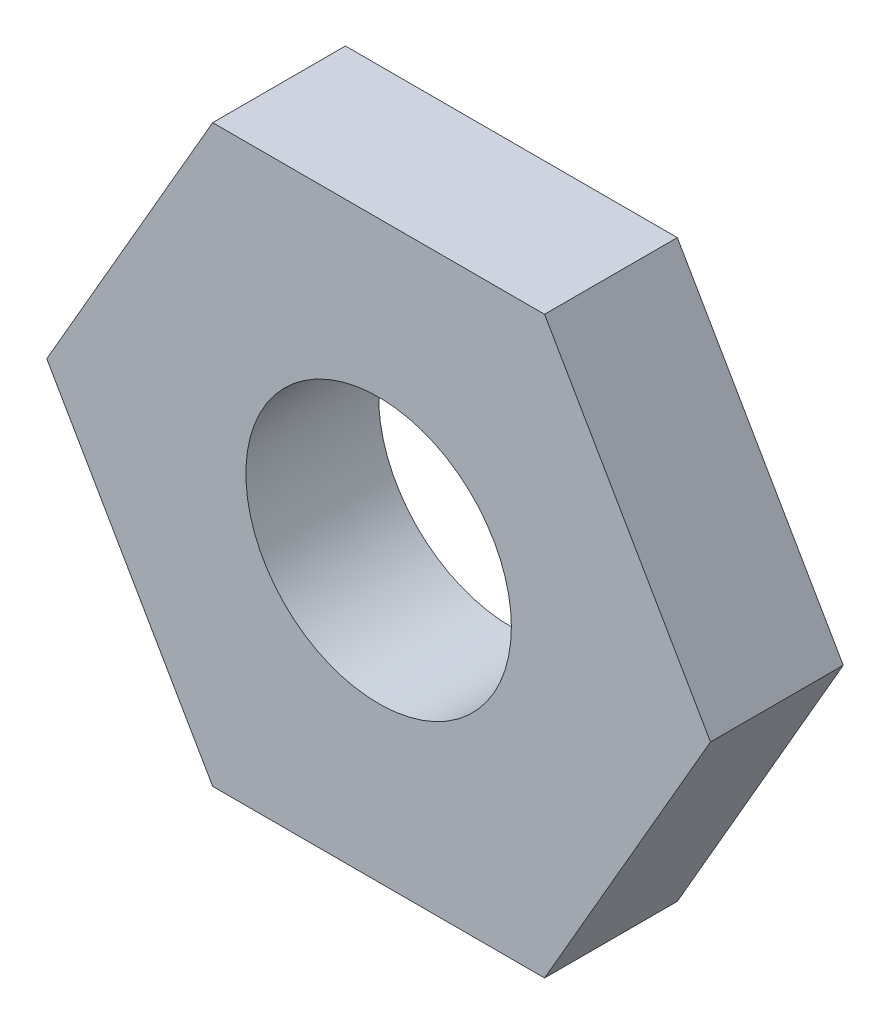
ISO-10303-21;
HEADER;
FILE_DESCRIPTION(('STEP AP214'),'2;1');
FILE_NAME('part.step','',(''),(''),'','','');
FILE_SCHEMA(('AUTOMOTIVE_DESIGN { 1 0 10303 214 1 1 1 1 }'));
ENDSEC;
DATA;
#1=APPLICATION_CONTEXT('core data for automotive mechanical design processes');
#2=APPLICATION_PROTOCOL_DEFINITION('international standard','automotive_design',2000,#1);
#3=PRODUCT_CONTEXT('',#1,'mechanical');
#4=PRODUCT('Part','Part','',(#3));
#5=PRODUCT_RELATED_PRODUCT_CATEGORY('part','',(#4));
#6=PRODUCT_DEFINITION_FORMATION('','',#4);
#7=PRODUCT_DEFINITION_CONTEXT('part definition',#1,'design');
#8=PRODUCT_DEFINITION('design','',#6,#7);
#9=PRODUCT_DEFINITION_SHAPE('','',#8);
#10=(LENGTH_UNIT() NAMED_UNIT(*) SI_UNIT(.MILLI.,.METRE.));
#11=(NAMED_UNIT(*) PLANE_ANGLE_UNIT() SI_UNIT($,.RADIAN.));
#12=(NAMED_UNIT(*) SI_UNIT($,.STERADIAN.) SOLID_ANGLE_UNIT());
#13=UNCERTAINTY_MEASURE_WITH_UNIT(LENGTH_MEASURE(1.E-05),#10,'distance_accuracy_value','');
#14=(GEOMETRIC_REPRESENTATION_CONTEXT(3) GLOBAL_UNCERTAINTY_ASSIGNED_CONTEXT((#13)) GLOBAL_UNIT_ASSIGNED_CONTEXT((#10,
#11,#12)) REPRESENTATION_CONTEXT('',''));
#15=CARTESIAN_POINT('',(0.,0.,0.));
#16=DIRECTION('',(0.,0.,1.));
#17=DIRECTION('',(1.,0.,0.));
#18=AXIS2_PLACEMENT_3D('',#15,#16,#17);
#19=CARTESIAN_POINT('',(0.,0.,2.));
#20=DIRECTION('',(0.,0.,-1.));
#21=DIRECTION('',(-1.,0.,0.));
#22=AXIS2_PLACEMENT_3D('',#19,#20,#21);
#23=PLANE('',#22);
#24=DIRECTION('',(0.499999942468329,-0.866025437000362,0.));
#25=VECTOR('',#24,1.);
#26=CARTESIAN_POINT('',(-2.50000028765834,-4.33012718500182,2.));
#27=LINE('',#26,#25);
#28=CARTESIAN_POINT('',(-4.99999999999999,0.,2.));
#29=VERTEX_POINT('',#28);
#30=CARTESIAN_POINT('',(-2.50000028765834,-4.33012718500182,2.));
#31=VERTEX_POINT('',#30);
#32=EDGE_CURVE('E129',#29,#31,#27,.T.);
#33=ORIENTED_EDGE('',*,*,#32,.T.);
#34=DIRECTION('',(1.,0.,0.));
#35=VECTOR('',#34,1.);
#36=CARTESIAN_POINT('',(2.49999990411389,-4.33012718500182,2.));
#37=LINE('',#36,#35);
#38=CARTESIAN_POINT('',(2.49999990411389,-4.33012718500182,2.));
#39=VERTEX_POINT('',#38);
#40=EDGE_CURVE('E87',#31,#39,#37,.T.);
#41=ORIENTED_EDGE('',*,*,#40,.T.);
#42=DIRECTION('',(0.499999999999998,0.86602540378444,0.));
#43=VECTOR('',#42,1.);
#44=CARTESIAN_POINT('',(4.99999999999999,0.,2.));
#45=LINE('',#44,#43);
#46=CARTESIAN_POINT('',(4.99999999999999,0.,2.));
#47=VERTEX_POINT('',#46);
#48=EDGE_CURVE('E100',#39,#47,#45,.T.);
#49=ORIENTED_EDGE('',*,*,#48,.T.);
#50=DIRECTION('',(-0.499999999999998,0.86602540378444,0.));
#51=VECTOR('',#50,1.);
#52=CARTESIAN_POINT('',(2.5,4.3301270189222,2.));
#53=LINE('',#52,#51);
#54=CARTESIAN_POINT('',(2.5,4.3301270189222,2.));
#55=VERTEX_POINT('',#54);
#56=EDGE_CURVE('E94',#47,#55,#53,.T.);
#57=ORIENTED_EDGE('',*,*,#56,.T.);
#58=DIRECTION('',(-1.,0.,0.));
#59=VECTOR('',#58,1.);
#60=CARTESIAN_POINT('',(-2.5,4.3301270189222,2.));
#61=LINE('',#60,#59);
#62=CARTESIAN_POINT('',(-2.5,4.3301270189222,2.));
#63=VERTEX_POINT('',#62);
#64=EDGE_CURVE('E98',#55,#63,#61,.T.);
#65=ORIENTED_EDGE('',*,*,#64,.T.);
#66=DIRECTION('',(-0.499999999999998,-0.86602540378444,0.));
#67=VECTOR('',#66,1.);
#68=CARTESIAN_POINT('',(-4.99999999999999,0.,2.));
#69=LINE('',#68,#67);
#70=EDGE_CURVE('E50',#63,#29,#69,.T.);
#71=ORIENTED_EDGE('',*,*,#70,.T.);
#72=EDGE_LOOP('',(#33,#41,#49,#57,#65,#71));
#73=FACE_BOUND('',#72,.T.);
#74=CARTESIAN_POINT('',(0.,0.,2.));
#75=DIRECTION('',(0.,0.,1.));
#76=DIRECTION('',(1.,0.,0.));
#77=AXIS2_PLACEMENT_3D('',#74,#75,#76);
#78=CIRCLE('',#77,2.);
#79=CARTESIAN_POINT('',(2.,0.,2.));
#80=VERTEX_POINT('',#79);
#81=EDGE_CURVE('E122',#80,#80,#78,.T.);
#82=ORIENTED_EDGE('',*,*,#81,.F.);
#83=EDGE_LOOP('',(#82));
#84=FACE_BOUND('',#83,.T.);
#85=ADVANCED_FACE('F33',(#73,#84),#23,.F.);
#86=CARTESIAN_POINT('',(0.,0.,0.));
#87=DIRECTION('',(0.,0.,-1.));
#88=DIRECTION('',(-1.,0.,0.));
#89=AXIS2_PLACEMENT_3D('',#86,#87,#88);
#90=PLANE('',#89);
#91=DIRECTION('',(0.499999942468329,-0.866025437000362,0.));
#92=VECTOR('',#91,1.);
#93=CARTESIAN_POINT('',(-2.50000028765834,-4.33012718500182,0.));
#94=LINE('',#93,#92);
#95=CARTESIAN_POINT('',(-4.99999999999999,0.,0.));
#96=VERTEX_POINT('',#95);
#97=CARTESIAN_POINT('',(-2.50000028765834,-4.33012718500182,0.));
#98=VERTEX_POINT('',#97);
#99=EDGE_CURVE('E118',#96,#98,#94,.T.);
#100=ORIENTED_EDGE('',*,*,#99,.F.);
#101=DIRECTION('',(-0.499999999999998,-0.86602540378444,0.));
#102=VECTOR('',#101,1.);
#103=CARTESIAN_POINT('',(-4.99999999999999,0.,0.));
#104=LINE('',#103,#102);
#105=CARTESIAN_POINT('',(-2.5,4.3301270189222,0.));
#106=VERTEX_POINT('',#105);
#107=EDGE_CURVE('E79',#106,#96,#104,.T.);
#108=ORIENTED_EDGE('',*,*,#107,.F.);
#109=DIRECTION('',(-1.,0.,0.));
#110=VECTOR('',#109,1.);
#111=CARTESIAN_POINT('',(-2.5,4.3301270189222,0.));
#112=LINE('',#111,#110);
#113=CARTESIAN_POINT('',(2.5,4.3301270189222,0.));
#114=VERTEX_POINT('',#113);
#115=EDGE_CURVE('E73',#114,#106,#112,.T.);
#116=ORIENTED_EDGE('',*,*,#115,.F.);
#117=DIRECTION('',(-0.499999999999998,0.86602540378444,0.));
#118=VECTOR('',#117,1.);
#119=CARTESIAN_POINT('',(2.5,4.3301270189222,0.));
#120=LINE('',#119,#118);
#121=CARTESIAN_POINT('',(4.99999999999999,0.,0.));
#122=VERTEX_POINT('',#121);
#123=EDGE_CURVE('E108',#122,#114,#120,.T.);
#124=ORIENTED_EDGE('',*,*,#123,.F.);
#125=DIRECTION('',(0.499999999999998,0.86602540378444,0.));
#126=VECTOR('',#125,1.);
#127=CARTESIAN_POINT('',(4.99999999999999,0.,0.));
#128=LINE('',#127,#126);
#129=CARTESIAN_POINT('',(2.49999990411389,-4.33012718500182,0.));
#130=VERTEX_POINT('',#129);
#131=EDGE_CURVE('E124',#130,#122,#128,.T.);
#132=ORIENTED_EDGE('',*,*,#131,.F.);
#133=DIRECTION('',(1.,0.,0.));
#134=VECTOR('',#133,1.);
#135=CARTESIAN_POINT('',(2.49999990411389,-4.33012718500182,0.));
#136=LINE('',#135,#134);
#137=EDGE_CURVE('E121',#98,#130,#136,.T.);
#138=ORIENTED_EDGE('',*,*,#137,.F.);
#139=EDGE_LOOP('',(#100,#108,#116,#124,#132,#138));
#140=FACE_BOUND('',#139,.T.);
#141=CARTESIAN_POINT('',(0.,0.,0.));
#142=DIRECTION('',(0.,0.,1.));
#143=DIRECTION('',(1.,0.,0.));
#144=AXIS2_PLACEMENT_3D('',#141,#142,#143);
#145=CIRCLE('',#144,2.);
#146=CARTESIAN_POINT('',(2.,0.,0.));
#147=VERTEX_POINT('',#146);
#148=EDGE_CURVE('E222',#147,#147,#145,.T.);
#149=ORIENTED_EDGE('',*,*,#148,.T.);
#150=EDGE_LOOP('',(#149));
#151=FACE_BOUND('',#150,.T.);
#152=ADVANCED_FACE('F138',(#140,#151),#90,.T.);
#153=CARTESIAN_POINT('',(-2.50000028765834,-4.33012718500182,2.));
#154=DIRECTION('',(0.866025437000362,0.499999942468329,0.));
#155=DIRECTION('',(-0.499999942468329,0.866025437000362,0.));
#156=AXIS2_PLACEMENT_3D('',#153,#154,#155);
#157=PLANE('',#156);
#158=ORIENTED_EDGE('',*,*,#99,.T.);
#159=DIRECTION('',(0.,0.,-1.));
#160=VECTOR('',#159,1.);
#161=CARTESIAN_POINT('',(-2.50000028765834,-4.33012718500182,2.));
#162=LINE('',#161,#160);
#163=EDGE_CURVE('E11',#31,#98,#162,.T.);
#164=ORIENTED_EDGE('',*,*,#163,.F.);
#165=ORIENTED_EDGE('',*,*,#32,.F.);
#166=DIRECTION('',(0.,0.,-1.));
#167=VECTOR('',#166,1.);
#168=CARTESIAN_POINT('',(-4.99999999999999,0.,2.));
#169=LINE('',#168,#167);
#170=EDGE_CURVE('E114',#29,#96,#169,.T.);
#171=ORIENTED_EDGE('',*,*,#170,.T.);
#172=EDGE_LOOP('',(#158,#164,#165,#171));
#173=FACE_BOUND('',#172,.T.);
#174=ADVANCED_FACE('F35',(#173),#157,.F.);
#175=CARTESIAN_POINT('',(2.49999990411389,-4.33012718500182,2.));
#176=DIRECTION('',(0.,1.,0.));
#177=DIRECTION('',(0.,0.,1.));
#178=AXIS2_PLACEMENT_3D('',#175,#176,#177);
#179=PLANE('',#178);
#180=ORIENTED_EDGE('',*,*,#137,.T.);
#181=DIRECTION('',(0.,0.,-1.));
#182=VECTOR('',#181,1.);
#183=CARTESIAN_POINT('',(2.49999990411389,-4.33012718500182,2.));
#184=LINE('',#183,#182);
#185=EDGE_CURVE('E42',#39,#130,#184,.T.);
#186=ORIENTED_EDGE('',*,*,#185,.F.);
#187=ORIENTED_EDGE('',*,*,#40,.F.);
#188=ORIENTED_EDGE('',*,*,#163,.T.);
#189=EDGE_LOOP('',(#180,#186,#187,#188));
#190=FACE_BOUND('',#189,.T.);
#191=ADVANCED_FACE('F163',(#190),#179,.F.);
#192=CARTESIAN_POINT('',(4.99999999999999,0.,2.));
#193=DIRECTION('',(-0.86602540378444,0.499999999999998,0.));
#194=DIRECTION('',(-0.499999999999998,-0.86602540378444,0.));
#195=AXIS2_PLACEMENT_3D('',#192,#193,#194);
#196=PLANE('',#195);
#197=ORIENTED_EDGE('',*,*,#131,.T.);
#198=DIRECTION('',(0.,0.,-1.));
#199=VECTOR('',#198,1.);
#200=CARTESIAN_POINT('',(4.99999999999999,0.,2.));
#201=LINE('',#200,#199);
#202=EDGE_CURVE('E109',#47,#122,#201,.T.);
#203=ORIENTED_EDGE('',*,*,#202,.F.);
#204=ORIENTED_EDGE('',*,*,#48,.F.);
#205=ORIENTED_EDGE('',*,*,#185,.T.);
#206=EDGE_LOOP('',(#197,#203,#204,#205));
#207=FACE_BOUND('',#206,.T.);
#208=ADVANCED_FACE('F135',(#207),#196,.F.);
#209=CARTESIAN_POINT('',(2.5,4.3301270189222,2.));
#210=DIRECTION('',(-0.86602540378444,-0.499999999999998,0.));
#211=DIRECTION('',(0.499999999999998,-0.86602540378444,0.));
#212=AXIS2_PLACEMENT_3D('',#209,#210,#211);
#213=PLANE('',#212);
#214=ORIENTED_EDGE('',*,*,#123,.T.);
#215=DIRECTION('',(0.,0.,-1.));
#216=VECTOR('',#215,1.);
#217=CARTESIAN_POINT('',(2.5,4.3301270189222,2.));
#218=LINE('',#217,#216);
#219=EDGE_CURVE('E105',#55,#114,#218,.T.);
#220=ORIENTED_EDGE('',*,*,#219,.F.);
#221=ORIENTED_EDGE('',*,*,#56,.F.);
#222=ORIENTED_EDGE('',*,*,#202,.T.);
#223=EDGE_LOOP('',(#214,#220,#221,#222));
#224=FACE_BOUND('',#223,.T.);
#225=ADVANCED_FACE('F106',(#224),#213,.F.);
#226=CARTESIAN_POINT('',(-2.5,4.3301270189222,2.));
#227=DIRECTION('',(0.,-1.,0.));
#228=DIRECTION('',(0.,0.,-1.));
#229=AXIS2_PLACEMENT_3D('',#226,#227,#228);
#230=PLANE('',#229);
#231=ORIENTED_EDGE('',*,*,#115,.T.);
#232=DIRECTION('',(0.,0.,-1.));
#233=VECTOR('',#232,1.);
#234=CARTESIAN_POINT('',(-2.5,4.3301270189222,2.));
#235=LINE('',#234,#233);
#236=EDGE_CURVE('E110',#63,#106,#235,.T.);
#237=ORIENTED_EDGE('',*,*,#236,.F.);
#238=ORIENTED_EDGE('',*,*,#64,.F.);
#239=ORIENTED_EDGE('',*,*,#219,.T.);
#240=EDGE_LOOP('',(#231,#237,#238,#239));
#241=FACE_BOUND('',#240,.T.);
#242=ADVANCED_FACE('F112',(#241),#230,.F.);
#243=CARTESIAN_POINT('',(-4.99999999999999,0.,2.));
#244=DIRECTION('',(0.86602540378444,-0.499999999999998,0.));
#245=DIRECTION('',(0.499999999999998,0.86602540378444,0.));
#246=AXIS2_PLACEMENT_3D('',#243,#244,#245);
#247=PLANE('',#246);
#248=ORIENTED_EDGE('',*,*,#107,.T.);
#249=ORIENTED_EDGE('',*,*,#170,.F.);
#250=ORIENTED_EDGE('',*,*,#70,.F.);
#251=ORIENTED_EDGE('',*,*,#236,.T.);
#252=EDGE_LOOP('',(#248,#249,#250,#251));
#253=FACE_BOUND('',#252,.T.);
#254=ADVANCED_FACE('F143',(#253),#247,.F.);
#255=CARTESIAN_POINT('',(0.,0.,2.));
#256=DIRECTION('',(0.,0.,-1.));
#257=DIRECTION('',(-1.,0.,0.));
#258=AXIS2_PLACEMENT_3D('',#255,#256,#257);
#259=CYLINDRICAL_SURFACE('',#258,2.);
#260=ORIENTED_EDGE('',*,*,#81,.T.);
#261=EDGE_LOOP('',(#260));
#262=FACE_BOUND('',#261,.T.);
#263=ORIENTED_EDGE('',*,*,#148,.F.);
#264=EDGE_LOOP('',(#263));
#265=FACE_BOUND('',#264,.T.);
#266=ADVANCED_FACE('F145',(#262,#265),#259,.F.);
#267=CLOSED_SHELL('',(#85,#152,#174,#191,#208,#225,#242,#254,#266));
#268=MANIFOLD_SOLID_BREP('B2',#267);
#269=ADVANCED_BREP_SHAPE_REPRESENTATION('',(#18,#268),#14);
#270=SHAPE_DEFINITION_REPRESENTATION(#9,#269);
ENDSEC;
END-ISO-10303-21;
